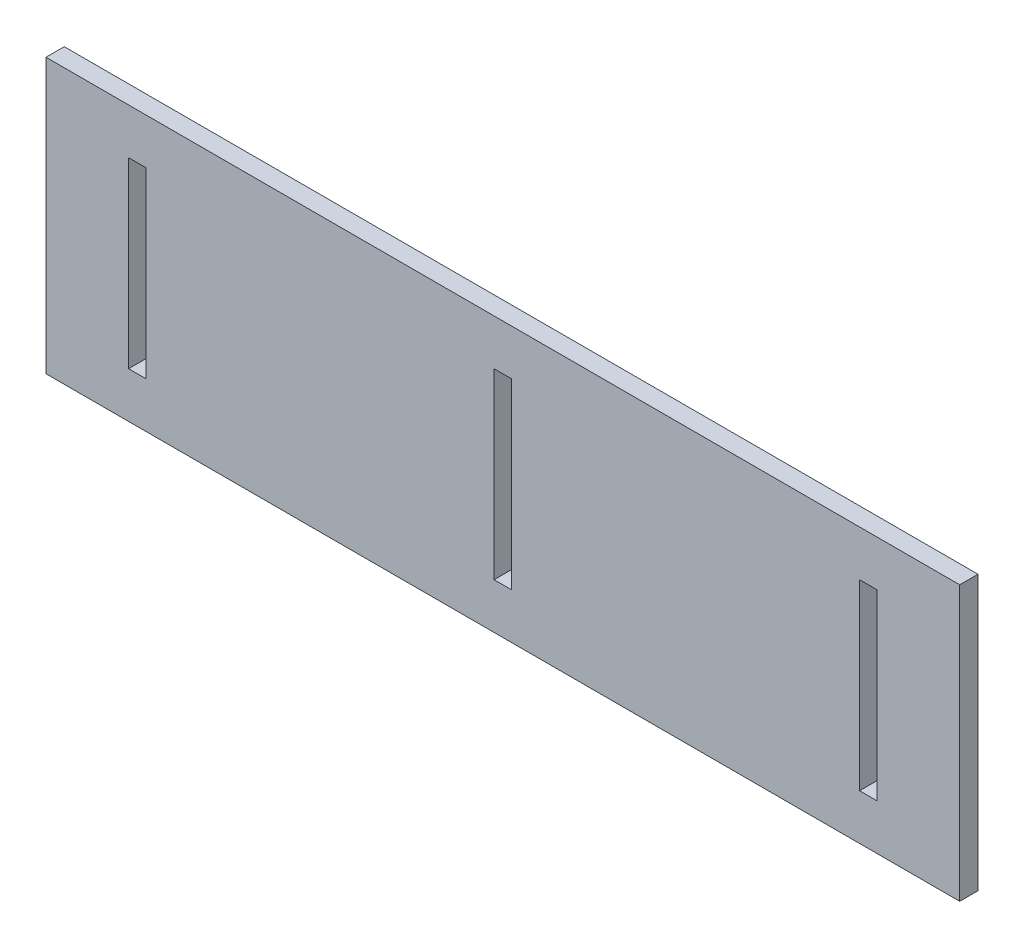
ISO-10303-21;
HEADER;
FILE_DESCRIPTION(('STEP AP214'),'2;1');
FILE_NAME('part.step','',(''),(''),'','','');
FILE_SCHEMA(('AUTOMOTIVE_DESIGN { 1 0 10303 214 1 1 1 1 }'));
ENDSEC;
DATA;
#1=APPLICATION_CONTEXT('core data for automotive mechanical design processes');
#2=APPLICATION_PROTOCOL_DEFINITION('international standard','automotive_design',2000,#1);
#3=PRODUCT_CONTEXT('',#1,'mechanical');
#4=PRODUCT('Part','Part','',(#3));
#5=PRODUCT_RELATED_PRODUCT_CATEGORY('part','',(#4));
#6=PRODUCT_DEFINITION_FORMATION('','',#4);
#7=PRODUCT_DEFINITION_CONTEXT('part definition',#1,'design');
#8=PRODUCT_DEFINITION('design','',#6,#7);
#9=PRODUCT_DEFINITION_SHAPE('','',#8);
#10=(LENGTH_UNIT() NAMED_UNIT(*) SI_UNIT(.MILLI.,.METRE.));
#11=(NAMED_UNIT(*) PLANE_ANGLE_UNIT() SI_UNIT($,.RADIAN.));
#12=(NAMED_UNIT(*) SI_UNIT($,.STERADIAN.) SOLID_ANGLE_UNIT());
#13=UNCERTAINTY_MEASURE_WITH_UNIT(LENGTH_MEASURE(1.E-05),#10,'distance_accuracy_value','');
#14=(GEOMETRIC_REPRESENTATION_CONTEXT(3) GLOBAL_UNCERTAINTY_ASSIGNED_CONTEXT((#13)) GLOBAL_UNIT_ASSIGNED_CONTEXT((#10,
#11,#12)) REPRESENTATION_CONTEXT('',''));
#15=CARTESIAN_POINT('',(0.,0.,0.));
#16=DIRECTION('',(0.,0.,1.));
#17=DIRECTION('',(1.,0.,0.));
#18=AXIS2_PLACEMENT_3D('',#15,#16,#17);
#19=CARTESIAN_POINT('',(125.01,37.5,-0.01));
#20=DIRECTION('',(0.,1.,0.));
#21=DIRECTION('',(-1.,0.,0.));
#22=AXIS2_PLACEMENT_3D('',#19,#20,#21);
#23=PLANE('',#22);
#24=DIRECTION('',(-1.,0.,0.));
#25=VECTOR('',#24,1.);
#26=CARTESIAN_POINT('',(0.,37.5,5.));
#27=LINE('',#26,#25);
#28=CARTESIAN_POINT('',(125.,37.5,5.));
#29=VERTEX_POINT('',#28);
#30=CARTESIAN_POINT('',(-125.,37.5,5.));
#31=VERTEX_POINT('',#30);
#32=EDGE_CURVE('E133',#29,#31,#27,.T.);
#33=ORIENTED_EDGE('',*,*,#32,.F.);
#34=DIRECTION('',(0.,0.,1.));
#35=VECTOR('',#34,1.);
#36=CARTESIAN_POINT('',(125.,37.5,2.5));
#37=LINE('',#36,#35);
#38=CARTESIAN_POINT('',(125.,37.5,0.));
#39=VERTEX_POINT('',#38);
#40=EDGE_CURVE('E130',#39,#29,#37,.T.);
#41=ORIENTED_EDGE('',*,*,#40,.F.);
#42=DIRECTION('',(1.,0.,0.));
#43=VECTOR('',#42,1.);
#44=CARTESIAN_POINT('',(0.,37.5,0.));
#45=LINE('',#44,#43);
#46=CARTESIAN_POINT('',(-125.,37.5,0.));
#47=VERTEX_POINT('',#46);
#48=EDGE_CURVE('E127',#47,#39,#45,.T.);
#49=ORIENTED_EDGE('',*,*,#48,.F.);
#50=DIRECTION('',(0.,0.,-1.));
#51=VECTOR('',#50,1.);
#52=CARTESIAN_POINT('',(-125.,37.5,2.5));
#53=LINE('',#52,#51);
#54=EDGE_CURVE('E20',#31,#47,#53,.T.);
#55=ORIENTED_EDGE('',*,*,#54,.F.);
#56=EDGE_LOOP('',(#33,#41,#49,#55));
#57=FACE_BOUND('',#56,.T.);
#58=ADVANCED_FACE('F16',(#57),#23,.T.);
#59=CARTESIAN_POINT('',(-125.,37.51,-0.01));
#60=DIRECTION('',(-1.,0.,0.));
#61=DIRECTION('',(0.,-1.,0.));
#62=AXIS2_PLACEMENT_3D('',#59,#60,#61);
#63=PLANE('',#62);
#64=DIRECTION('',(0.,-1.,0.));
#65=VECTOR('',#64,1.);
#66=CARTESIAN_POINT('',(-125.,0.,5.));
#67=LINE('',#66,#65);
#68=CARTESIAN_POINT('',(-125.,-37.5,5.));
#69=VERTEX_POINT('',#68);
#70=EDGE_CURVE('E181',#31,#69,#67,.T.);
#71=ORIENTED_EDGE('',*,*,#70,.F.);
#72=ORIENTED_EDGE('',*,*,#54,.T.);
#73=DIRECTION('',(0.,1.,0.));
#74=VECTOR('',#73,1.);
#75=CARTESIAN_POINT('',(-125.,0.,0.));
#76=LINE('',#75,#74);
#77=CARTESIAN_POINT('',(-125.,-37.5,0.));
#78=VERTEX_POINT('',#77);
#79=EDGE_CURVE('E151',#78,#47,#76,.T.);
#80=ORIENTED_EDGE('',*,*,#79,.F.);
#81=DIRECTION('',(0.,0.,-1.));
#82=VECTOR('',#81,1.);
#83=CARTESIAN_POINT('',(-125.,-37.5,2.5));
#84=LINE('',#83,#82);
#85=EDGE_CURVE('E138',#69,#78,#84,.T.);
#86=ORIENTED_EDGE('',*,*,#85,.F.);
#87=EDGE_LOOP('',(#71,#72,#80,#86));
#88=FACE_BOUND('',#87,.T.);
#89=ADVANCED_FACE('F179',(#88),#63,.T.);
#90=CARTESIAN_POINT('',(-125.01,-37.5,-0.01));
#91=DIRECTION('',(0.,-1.,0.));
#92=DIRECTION('',(1.,0.,0.));
#93=AXIS2_PLACEMENT_3D('',#90,#91,#92);
#94=PLANE('',#93);
#95=DIRECTION('',(1.,0.,0.));
#96=VECTOR('',#95,1.);
#97=CARTESIAN_POINT('',(0.,-37.5,5.));
#98=LINE('',#97,#96);
#99=CARTESIAN_POINT('',(125.,-37.5,5.));
#100=VERTEX_POINT('',#99);
#101=EDGE_CURVE('E184',#69,#100,#98,.T.);
#102=ORIENTED_EDGE('',*,*,#101,.F.);
#103=ORIENTED_EDGE('',*,*,#85,.T.);
#104=DIRECTION('',(-1.,0.,0.));
#105=VECTOR('',#104,1.);
#106=CARTESIAN_POINT('',(0.,-37.5,0.));
#107=LINE('',#106,#105);
#108=CARTESIAN_POINT('',(125.,-37.5,0.));
#109=VERTEX_POINT('',#108);
#110=EDGE_CURVE('E146',#109,#78,#107,.T.);
#111=ORIENTED_EDGE('',*,*,#110,.F.);
#112=DIRECTION('',(0.,0.,-1.));
#113=VECTOR('',#112,1.);
#114=CARTESIAN_POINT('',(125.,-37.5,2.5));
#115=LINE('',#114,#113);
#116=EDGE_CURVE('E137',#100,#109,#115,.T.);
#117=ORIENTED_EDGE('',*,*,#116,.F.);
#118=EDGE_LOOP('',(#102,#103,#111,#117));
#119=FACE_BOUND('',#118,.T.);
#120=ADVANCED_FACE('F222',(#119),#94,.T.);
#121=CARTESIAN_POINT('',(125.,-37.51,-0.01));
#122=DIRECTION('',(1.,0.,0.));
#123=DIRECTION('',(0.,1.,0.));
#124=AXIS2_PLACEMENT_3D('',#121,#122,#123);
#125=PLANE('',#124);
#126=DIRECTION('',(0.,1.,0.));
#127=VECTOR('',#126,1.);
#128=CARTESIAN_POINT('',(125.,0.,5.));
#129=LINE('',#128,#127);
#130=EDGE_CURVE('E187',#100,#29,#129,.T.);
#131=ORIENTED_EDGE('',*,*,#130,.F.);
#132=ORIENTED_EDGE('',*,*,#116,.T.);
#133=DIRECTION('',(0.,-1.,0.));
#134=VECTOR('',#133,1.);
#135=CARTESIAN_POINT('',(125.,0.,0.));
#136=LINE('',#135,#134);
#137=EDGE_CURVE('E141',#39,#109,#136,.T.);
#138=ORIENTED_EDGE('',*,*,#137,.F.);
#139=ORIENTED_EDGE('',*,*,#40,.T.);
#140=EDGE_LOOP('',(#131,#132,#138,#139));
#141=FACE_BOUND('',#140,.T.);
#142=ADVANCED_FACE('F142',(#141),#125,.T.);
#143=CARTESIAN_POINT('',(2.4,-25.01,5.01));
#144=DIRECTION('',(-1.,0.,0.));
#145=DIRECTION('',(0.,1.,0.));
#146=AXIS2_PLACEMENT_3D('',#143,#144,#145);
#147=PLANE('',#146);
#148=DIRECTION('',(0.,-1.,0.));
#149=VECTOR('',#148,1.);
#150=CARTESIAN_POINT('',(2.40000000000001,0.,5.));
#151=LINE('',#150,#149);
#152=CARTESIAN_POINT('',(2.4,25.,5.));
#153=VERTEX_POINT('',#152);
#154=CARTESIAN_POINT('',(2.4,-25.,5.));
#155=VERTEX_POINT('',#154);
#156=EDGE_CURVE('E230',#153,#155,#151,.T.);
#157=ORIENTED_EDGE('',*,*,#156,.F.);
#158=DIRECTION('',(0.,0.,1.));
#159=VECTOR('',#158,1.);
#160=CARTESIAN_POINT('',(2.4,25.,2.5));
#161=LINE('',#160,#159);
#162=CARTESIAN_POINT('',(2.4,25.,0.));
#163=VERTEX_POINT('',#162);
#164=EDGE_CURVE('E167',#163,#153,#161,.T.);
#165=ORIENTED_EDGE('',*,*,#164,.F.);
#166=DIRECTION('',(0.,1.,0.));
#167=VECTOR('',#166,1.);
#168=CARTESIAN_POINT('',(2.4,0.,0.));
#169=LINE('',#168,#167);
#170=CARTESIAN_POINT('',(2.4,-25.,0.));
#171=VERTEX_POINT('',#170);
#172=EDGE_CURVE('E217',#171,#163,#169,.T.);
#173=ORIENTED_EDGE('',*,*,#172,.F.);
#174=DIRECTION('',(0.,0.,-1.));
#175=VECTOR('',#174,1.);
#176=CARTESIAN_POINT('',(2.4,-25.,2.5));
#177=LINE('',#176,#175);
#178=EDGE_CURVE('E172',#155,#171,#177,.T.);
#179=ORIENTED_EDGE('',*,*,#178,.F.);
#180=EDGE_LOOP('',(#157,#165,#173,#179));
#181=FACE_BOUND('',#180,.T.);
#182=ADVANCED_FACE('F317',(#181),#147,.T.);
#183=CARTESIAN_POINT('',(-2.41,-25.,5.01));
#184=DIRECTION('',(0.,1.,0.));
#185=DIRECTION('',(1.,0.,0.));
#186=AXIS2_PLACEMENT_3D('',#183,#184,#185);
#187=PLANE('',#186);
#188=DIRECTION('',(-1.,0.,0.));
#189=VECTOR('',#188,1.);
#190=CARTESIAN_POINT('',(0.,-25.,5.));
#191=LINE('',#190,#189);
#192=CARTESIAN_POINT('',(-2.4,-25.,5.));
#193=VERTEX_POINT('',#192);
#194=EDGE_CURVE('E233',#155,#193,#191,.T.);
#195=ORIENTED_EDGE('',*,*,#194,.F.);
#196=ORIENTED_EDGE('',*,*,#178,.T.);
#197=DIRECTION('',(1.,0.,0.));
#198=VECTOR('',#197,1.);
#199=CARTESIAN_POINT('',(0.,-25.,0.));
#200=LINE('',#199,#198);
#201=CARTESIAN_POINT('',(-2.4,-25.,0.));
#202=VERTEX_POINT('',#201);
#203=EDGE_CURVE('E208',#202,#171,#200,.T.);
#204=ORIENTED_EDGE('',*,*,#203,.F.);
#205=DIRECTION('',(0.,0.,-1.));
#206=VECTOR('',#205,1.);
#207=CARTESIAN_POINT('',(-2.4,-25.,2.5));
#208=LINE('',#207,#206);
#209=EDGE_CURVE('E170',#193,#202,#208,.T.);
#210=ORIENTED_EDGE('',*,*,#209,.F.);
#211=EDGE_LOOP('',(#195,#196,#204,#210));
#212=FACE_BOUND('',#211,.T.);
#213=ADVANCED_FACE('F319',(#212),#187,.T.);
#214=CARTESIAN_POINT('',(-2.4,25.01,5.01));
#215=DIRECTION('',(1.,0.,0.));
#216=DIRECTION('',(0.,-1.,0.));
#217=AXIS2_PLACEMENT_3D('',#214,#215,#216);
#218=PLANE('',#217);
#219=DIRECTION('',(0.,1.,0.));
#220=VECTOR('',#219,1.);
#221=CARTESIAN_POINT('',(-2.4,0.,5.));
#222=LINE('',#221,#220);
#223=CARTESIAN_POINT('',(-2.4,25.,5.));
#224=VERTEX_POINT('',#223);
#225=EDGE_CURVE('E236',#193,#224,#222,.T.);
#226=ORIENTED_EDGE('',*,*,#225,.F.);
#227=ORIENTED_EDGE('',*,*,#209,.T.);
#228=DIRECTION('',(0.,-1.,0.));
#229=VECTOR('',#228,1.);
#230=CARTESIAN_POINT('',(-2.40000000000001,0.,0.));
#231=LINE('',#230,#229);
#232=CARTESIAN_POINT('',(-2.4,25.,0.));
#233=VERTEX_POINT('',#232);
#234=EDGE_CURVE('E211',#233,#202,#231,.T.);
#235=ORIENTED_EDGE('',*,*,#234,.F.);
#236=DIRECTION('',(0.,0.,-1.));
#237=VECTOR('',#236,1.);
#238=CARTESIAN_POINT('',(-2.4,25.,2.5));
#239=LINE('',#238,#237);
#240=EDGE_CURVE('E165',#224,#233,#239,.T.);
#241=ORIENTED_EDGE('',*,*,#240,.F.);
#242=EDGE_LOOP('',(#226,#227,#235,#241));
#243=FACE_BOUND('',#242,.T.);
#244=ADVANCED_FACE('F310',(#243),#218,.T.);
#245=CARTESIAN_POINT('',(2.41,25.,5.01));
#246=DIRECTION('',(0.,-1.,0.));
#247=DIRECTION('',(-1.,0.,0.));
#248=AXIS2_PLACEMENT_3D('',#245,#246,#247);
#249=PLANE('',#248);
#250=DIRECTION('',(1.,0.,0.));
#251=VECTOR('',#250,1.);
#252=CARTESIAN_POINT('',(0.,25.,5.));
#253=LINE('',#252,#251);
#254=EDGE_CURVE('E239',#224,#153,#253,.T.);
#255=ORIENTED_EDGE('',*,*,#254,.F.);
#256=ORIENTED_EDGE('',*,*,#240,.T.);
#257=DIRECTION('',(-1.,0.,0.));
#258=VECTOR('',#257,1.);
#259=CARTESIAN_POINT('',(0.,25.,0.));
#260=LINE('',#259,#258);
#261=EDGE_CURVE('E214',#163,#233,#260,.T.);
#262=ORIENTED_EDGE('',*,*,#261,.F.);
#263=ORIENTED_EDGE('',*,*,#164,.T.);
#264=EDGE_LOOP('',(#255,#256,#262,#263));
#265=FACE_BOUND('',#264,.T.);
#266=ADVANCED_FACE('F315',(#265),#249,.T.);
#267=CARTESIAN_POINT('',(-97.6,-25.0099999999999,5.01));
#268=DIRECTION('',(-1.,0.,0.));
#269=DIRECTION('',(0.,1.,0.));
#270=AXIS2_PLACEMENT_3D('',#267,#268,#269);
#271=PLANE('',#270);
#272=DIRECTION('',(0.,-1.,0.));
#273=VECTOR('',#272,1.);
#274=CARTESIAN_POINT('',(-97.6,0.,5.));
#275=LINE('',#274,#273);
#276=CARTESIAN_POINT('',(-97.6,25.0000000000001,5.));
#277=VERTEX_POINT('',#276);
#278=CARTESIAN_POINT('',(-97.6,-24.9999999999999,5.));
#279=VERTEX_POINT('',#278);
#280=EDGE_CURVE('E242',#277,#279,#275,.T.);
#281=ORIENTED_EDGE('',*,*,#280,.F.);
#282=DIRECTION('',(0.,0.,1.));
#283=VECTOR('',#282,1.);
#284=CARTESIAN_POINT('',(-97.6,25.0000000000001,2.5));
#285=LINE('',#284,#283);
#286=CARTESIAN_POINT('',(-97.6,25.0000000000001,0.));
#287=VERTEX_POINT('',#286);
#288=EDGE_CURVE('E154',#287,#277,#285,.T.);
#289=ORIENTED_EDGE('',*,*,#288,.F.);
#290=DIRECTION('',(0.,1.,0.));
#291=VECTOR('',#290,1.);
#292=CARTESIAN_POINT('',(-97.6,0.,0.));
#293=LINE('',#292,#291);
#294=CARTESIAN_POINT('',(-97.6,-24.9999999999999,0.));
#295=VERTEX_POINT('',#294);
#296=EDGE_CURVE('E205',#295,#287,#293,.T.);
#297=ORIENTED_EDGE('',*,*,#296,.F.);
#298=DIRECTION('',(0.,0.,-1.));
#299=VECTOR('',#298,1.);
#300=CARTESIAN_POINT('',(-97.6,-24.9999999999999,2.5));
#301=LINE('',#300,#299);
#302=EDGE_CURVE('E162',#279,#295,#301,.T.);
#303=ORIENTED_EDGE('',*,*,#302,.F.);
#304=EDGE_LOOP('',(#281,#289,#297,#303));
#305=FACE_BOUND('',#304,.T.);
#306=ADVANCED_FACE('F332',(#305),#271,.T.);
#307=CARTESIAN_POINT('',(-102.41,-24.9999999999999,5.01));
#308=DIRECTION('',(0.,1.,0.));
#309=DIRECTION('',(1.,0.,0.));
#310=AXIS2_PLACEMENT_3D('',#307,#308,#309);
#311=PLANE('',#310);
#312=DIRECTION('',(-1.,0.,0.));
#313=VECTOR('',#312,1.);
#314=CARTESIAN_POINT('',(0.,-24.9999999999999,5.));
#315=LINE('',#314,#313);
#316=CARTESIAN_POINT('',(-102.4,-24.9999999999999,5.));
#317=VERTEX_POINT('',#316);
#318=EDGE_CURVE('E245',#279,#317,#315,.T.);
#319=ORIENTED_EDGE('',*,*,#318,.F.);
#320=ORIENTED_EDGE('',*,*,#302,.T.);
#321=DIRECTION('',(1.,0.,0.));
#322=VECTOR('',#321,1.);
#323=CARTESIAN_POINT('',(0.,-24.9999999999999,0.));
#324=LINE('',#323,#322);
#325=CARTESIAN_POINT('',(-102.4,-24.9999999999999,0.));
#326=VERTEX_POINT('',#325);
#327=EDGE_CURVE('E196',#326,#295,#324,.T.);
#328=ORIENTED_EDGE('',*,*,#327,.F.);
#329=DIRECTION('',(0.,0.,-1.));
#330=VECTOR('',#329,1.);
#331=CARTESIAN_POINT('',(-102.4,-24.9999999999999,2.5));
#332=LINE('',#331,#330);
#333=EDGE_CURVE('E160',#317,#326,#332,.T.);
#334=ORIENTED_EDGE('',*,*,#333,.F.);
#335=EDGE_LOOP('',(#319,#320,#328,#334));
#336=FACE_BOUND('',#335,.T.);
#337=ADVANCED_FACE('F335',(#336),#311,.T.);
#338=CARTESIAN_POINT('',(-102.4,25.0100000000001,5.01));
#339=DIRECTION('',(1.,0.,0.));
#340=DIRECTION('',(0.,-1.,0.));
#341=AXIS2_PLACEMENT_3D('',#338,#339,#340);
#342=PLANE('',#341);
#343=DIRECTION('',(0.,1.,0.));
#344=VECTOR('',#343,1.);
#345=CARTESIAN_POINT('',(-102.4,0.,5.));
#346=LINE('',#345,#344);
#347=CARTESIAN_POINT('',(-102.4,25.0000000000001,5.));
#348=VERTEX_POINT('',#347);
#349=EDGE_CURVE('E248',#317,#348,#346,.T.);
#350=ORIENTED_EDGE('',*,*,#349,.F.);
#351=ORIENTED_EDGE('',*,*,#333,.T.);
#352=DIRECTION('',(0.,-1.,0.));
#353=VECTOR('',#352,1.);
#354=CARTESIAN_POINT('',(-102.4,0.,0.));
#355=LINE('',#354,#353);
#356=CARTESIAN_POINT('',(-102.4,25.0000000000001,0.));
#357=VERTEX_POINT('',#356);
#358=EDGE_CURVE('E199',#357,#326,#355,.T.);
#359=ORIENTED_EDGE('',*,*,#358,.F.);
#360=DIRECTION('',(0.,0.,-1.));
#361=VECTOR('',#360,1.);
#362=CARTESIAN_POINT('',(-102.4,25.0000000000001,2.5));
#363=LINE('',#362,#361);
#364=EDGE_CURVE('E152',#348,#357,#363,.T.);
#365=ORIENTED_EDGE('',*,*,#364,.F.);
#366=EDGE_LOOP('',(#350,#351,#359,#365));
#367=FACE_BOUND('',#366,.T.);
#368=ADVANCED_FACE('F339',(#367),#342,.T.);
#369=CARTESIAN_POINT('',(-97.59,25.0000000000001,5.01));
#370=DIRECTION('',(0.,-1.,0.));
#371=DIRECTION('',(-1.,0.,0.));
#372=AXIS2_PLACEMENT_3D('',#369,#370,#371);
#373=PLANE('',#372);
#374=DIRECTION('',(1.,0.,0.));
#375=VECTOR('',#374,1.);
#376=CARTESIAN_POINT('',(0.,25.0000000000001,5.));
#377=LINE('',#376,#375);
#378=EDGE_CURVE('E251',#348,#277,#377,.T.);
#379=ORIENTED_EDGE('',*,*,#378,.F.);
#380=ORIENTED_EDGE('',*,*,#364,.T.);
#381=DIRECTION('',(-1.,0.,0.));
#382=VECTOR('',#381,1.);
#383=CARTESIAN_POINT('',(0.,25.0000000000001,0.));
#384=LINE('',#383,#382);
#385=EDGE_CURVE('E202',#287,#357,#384,.T.);
#386=ORIENTED_EDGE('',*,*,#385,.F.);
#387=ORIENTED_EDGE('',*,*,#288,.T.);
#388=EDGE_LOOP('',(#379,#380,#386,#387));
#389=FACE_BOUND('',#388,.T.);
#390=ADVANCED_FACE('F290',(#389),#373,.T.);
#391=CARTESIAN_POINT('',(97.6000000000001,25.0099999999996,5.01));
#392=DIRECTION('',(1.,0.,0.));
#393=DIRECTION('',(0.,-1.,0.));
#394=AXIS2_PLACEMENT_3D('',#391,#392,#393);
#395=PLANE('',#394);
#396=DIRECTION('',(0.,1.,0.));
#397=VECTOR('',#396,1.);
#398=CARTESIAN_POINT('',(97.6000000000001,0.,5.));
#399=LINE('',#398,#397);
#400=CARTESIAN_POINT('',(97.6000000000001,-25.0000000000005,5.));
#401=VERTEX_POINT('',#400);
#402=CARTESIAN_POINT('',(97.6000000000001,24.9999999999995,5.));
#403=VERTEX_POINT('',#402);
#404=EDGE_CURVE('E228',#401,#403,#399,.T.);
#405=ORIENTED_EDGE('',*,*,#404,.F.);
#406=DIRECTION('',(0.,0.,1.));
#407=VECTOR('',#406,1.);
#408=CARTESIAN_POINT('',(97.6000000000001,-25.0000000000005,2.5));
#409=LINE('',#408,#407);
#410=CARTESIAN_POINT('',(97.6000000000001,-25.0000000000005,0.));
#411=VERTEX_POINT('',#410);
#412=EDGE_CURVE('E188',#411,#401,#409,.T.);
#413=ORIENTED_EDGE('',*,*,#412,.F.);
#414=DIRECTION('',(0.,-1.,0.));
#415=VECTOR('',#414,1.);
#416=CARTESIAN_POINT('',(97.6000000000001,0.,0.));
#417=LINE('',#416,#415);
#418=CARTESIAN_POINT('',(97.6000000000001,24.9999999999995,0.));
#419=VERTEX_POINT('',#418);
#420=EDGE_CURVE('E220',#419,#411,#417,.T.);
#421=ORIENTED_EDGE('',*,*,#420,.F.);
#422=DIRECTION('',(0.,0.,-1.));
#423=VECTOR('',#422,1.);
#424=CARTESIAN_POINT('',(97.6000000000001,24.9999999999995,2.5));
#425=LINE('',#424,#423);
#426=EDGE_CURVE('E258',#403,#419,#425,.T.);
#427=ORIENTED_EDGE('',*,*,#426,.F.);
#428=EDGE_LOOP('',(#405,#413,#421,#427));
#429=FACE_BOUND('',#428,.T.);
#430=ADVANCED_FACE('F276',(#429),#395,.T.);
#431=CARTESIAN_POINT('',(125.01,-37.51,0.));
#432=DIRECTION('',(0.,0.,-1.));
#433=DIRECTION('',(-1.,0.,0.));
#434=AXIS2_PLACEMENT_3D('',#431,#432,#433);
#435=PLANE('',#434);
#436=ORIENTED_EDGE('',*,*,#358,.T.);
#437=ORIENTED_EDGE('',*,*,#327,.T.);
#438=ORIENTED_EDGE('',*,*,#296,.T.);
#439=ORIENTED_EDGE('',*,*,#385,.T.);
#440=EDGE_LOOP('',(#436,#437,#438,#439));
#441=FACE_BOUND('',#440,.T.);
#442=ORIENTED_EDGE('',*,*,#234,.T.);
#443=ORIENTED_EDGE('',*,*,#203,.T.);
#444=ORIENTED_EDGE('',*,*,#172,.T.);
#445=ORIENTED_EDGE('',*,*,#261,.T.);
#446=EDGE_LOOP('',(#442,#443,#444,#445));
#447=FACE_BOUND('',#446,.T.);
#448=ORIENTED_EDGE('',*,*,#420,.T.);
#449=DIRECTION('',(-1.,0.,0.));
#450=VECTOR('',#449,1.);
#451=CARTESIAN_POINT('',(100.,-25.0000000000005,0.));
#452=LINE('',#451,#450);
#453=CARTESIAN_POINT('',(102.4,-25.0000000000005,0.));
#454=VERTEX_POINT('',#453);
#455=EDGE_CURVE('E190',#454,#411,#452,.T.);
#456=ORIENTED_EDGE('',*,*,#455,.F.);
#457=DIRECTION('',(0.,-1.,0.));
#458=VECTOR('',#457,1.);
#459=CARTESIAN_POINT('',(102.4,-4.9439619065339E-13,0.));
#460=LINE('',#459,#458);
#461=CARTESIAN_POINT('',(102.4,24.9999999999995,0.));
#462=VERTEX_POINT('',#461);
#463=EDGE_CURVE('E261',#462,#454,#460,.T.);
#464=ORIENTED_EDGE('',*,*,#463,.F.);
#465=DIRECTION('',(1.,0.,0.));
#466=VECTOR('',#465,1.);
#467=CARTESIAN_POINT('',(100.,24.9999999999995,0.));
#468=LINE('',#467,#466);
#469=EDGE_CURVE('E254',#419,#462,#468,.T.);
#470=ORIENTED_EDGE('',*,*,#469,.F.);
#471=EDGE_LOOP('',(#448,#456,#464,#470));
#472=FACE_BOUND('',#471,.T.);
#473=ORIENTED_EDGE('',*,*,#110,.T.);
#474=ORIENTED_EDGE('',*,*,#79,.T.);
#475=ORIENTED_EDGE('',*,*,#48,.T.);
#476=ORIENTED_EDGE('',*,*,#137,.T.);
#477=EDGE_LOOP('',(#473,#474,#475,#476));
#478=FACE_BOUND('',#477,.T.);
#479=ADVANCED_FACE('F149',(#441,#447,#472,#478),#435,.T.);
#480=CARTESIAN_POINT('',(97.5900000000001,-25.0000000000005,5.01));
#481=DIRECTION('',(0.,1.,0.));
#482=DIRECTION('',(1.,0.,0.));
#483=AXIS2_PLACEMENT_3D('',#480,#481,#482);
#484=PLANE('',#483);
#485=DIRECTION('',(-1.,0.,0.));
#486=VECTOR('',#485,1.);
#487=CARTESIAN_POINT('',(0.,-25.0000000000005,5.));
#488=LINE('',#487,#486);
#489=CARTESIAN_POINT('',(102.4,-25.0000000000005,5.));
#490=VERTEX_POINT('',#489);
#491=EDGE_CURVE('E223',#490,#401,#488,.T.);
#492=ORIENTED_EDGE('',*,*,#491,.F.);
#493=DIRECTION('',(0.,0.,1.));
#494=VECTOR('',#493,1.);
#495=CARTESIAN_POINT('',(102.4,-25.0000000000005,2.5));
#496=LINE('',#495,#494);
#497=EDGE_CURVE('E264',#454,#490,#496,.T.);
#498=ORIENTED_EDGE('',*,*,#497,.F.);
#499=ORIENTED_EDGE('',*,*,#455,.T.);
#500=ORIENTED_EDGE('',*,*,#412,.T.);
#501=EDGE_LOOP('',(#492,#498,#499,#500));
#502=FACE_BOUND('',#501,.T.);
#503=ADVANCED_FACE('F273',(#502),#484,.T.);
#504=CARTESIAN_POINT('',(-125.01,-37.51,5.));
#505=DIRECTION('',(0.,0.,1.));
#506=DIRECTION('',(1.,0.,0.));
#507=AXIS2_PLACEMENT_3D('',#504,#505,#506);
#508=PLANE('',#507);
#509=ORIENTED_EDGE('',*,*,#349,.T.);
#510=ORIENTED_EDGE('',*,*,#378,.T.);
#511=ORIENTED_EDGE('',*,*,#280,.T.);
#512=ORIENTED_EDGE('',*,*,#318,.T.);
#513=EDGE_LOOP('',(#509,#510,#511,#512));
#514=FACE_BOUND('',#513,.T.);
#515=ORIENTED_EDGE('',*,*,#225,.T.);
#516=ORIENTED_EDGE('',*,*,#254,.T.);
#517=ORIENTED_EDGE('',*,*,#156,.T.);
#518=ORIENTED_EDGE('',*,*,#194,.T.);
#519=EDGE_LOOP('',(#515,#516,#517,#518));
#520=FACE_BOUND('',#519,.T.);
#521=ORIENTED_EDGE('',*,*,#404,.T.);
#522=DIRECTION('',(-1.,0.,0.));
#523=VECTOR('',#522,1.);
#524=CARTESIAN_POINT('',(100.,24.9999999999995,5.));
#525=LINE('',#524,#523);
#526=CARTESIAN_POINT('',(102.4,24.9999999999995,5.));
#527=VERTEX_POINT('',#526);
#528=EDGE_CURVE('E35',#527,#403,#525,.T.);
#529=ORIENTED_EDGE('',*,*,#528,.F.);
#530=DIRECTION('',(0.,1.,0.));
#531=VECTOR('',#530,1.);
#532=CARTESIAN_POINT('',(102.4,-4.96130914129367E-13,5.));
#533=LINE('',#532,#531);
#534=EDGE_CURVE('E26',#490,#527,#533,.T.);
#535=ORIENTED_EDGE('',*,*,#534,.F.);
#536=ORIENTED_EDGE('',*,*,#491,.T.);
#537=EDGE_LOOP('',(#521,#529,#535,#536));
#538=FACE_BOUND('',#537,.T.);
#539=ORIENTED_EDGE('',*,*,#101,.T.);
#540=ORIENTED_EDGE('',*,*,#130,.T.);
#541=ORIENTED_EDGE('',*,*,#32,.T.);
#542=ORIENTED_EDGE('',*,*,#70,.T.);
#543=EDGE_LOOP('',(#539,#540,#541,#542));
#544=FACE_BOUND('',#543,.T.);
#545=ADVANCED_FACE('F186',(#514,#520,#538,#544),#508,.T.);
#546=CARTESIAN_POINT('',(102.41,24.9999999999995,5.01));
#547=DIRECTION('',(0.,-1.,0.));
#548=DIRECTION('',(-1.,0.,0.));
#549=AXIS2_PLACEMENT_3D('',#546,#547,#548);
#550=PLANE('',#549);
#551=ORIENTED_EDGE('',*,*,#528,.T.);
#552=ORIENTED_EDGE('',*,*,#426,.T.);
#553=ORIENTED_EDGE('',*,*,#469,.T.);
#554=DIRECTION('',(0.,0.,-1.));
#555=VECTOR('',#554,1.);
#556=CARTESIAN_POINT('',(102.4,24.9999999999995,2.5));
#557=LINE('',#556,#555);
#558=EDGE_CURVE('E11',#527,#462,#557,.T.);
#559=ORIENTED_EDGE('',*,*,#558,.F.);
#560=EDGE_LOOP('',(#551,#552,#553,#559));
#561=FACE_BOUND('',#560,.T.);
#562=ADVANCED_FACE('F279',(#561),#550,.T.);
#563=CARTESIAN_POINT('',(102.4,-25.0100000000005,5.01));
#564=DIRECTION('',(-1.,0.,0.));
#565=DIRECTION('',(0.,1.,0.));
#566=AXIS2_PLACEMENT_3D('',#563,#564,#565);
#567=PLANE('',#566);
#568=ORIENTED_EDGE('',*,*,#534,.T.);
#569=ORIENTED_EDGE('',*,*,#558,.T.);
#570=ORIENTED_EDGE('',*,*,#463,.T.);
#571=ORIENTED_EDGE('',*,*,#497,.T.);
#572=EDGE_LOOP('',(#568,#569,#570,#571));
#573=FACE_BOUND('',#572,.T.);
#574=ADVANCED_FACE('F18',(#573),#567,.T.);
#575=CLOSED_SHELL('',(#58,#89,#120,#142,#182,#213,#244,#266,#306,#337,#368,#390,#430,#479,#503,
#545,#562,#574));
#576=MANIFOLD_SOLID_BREP('B1',#575);
#577=ADVANCED_BREP_SHAPE_REPRESENTATION('',(#18,#576),#14);
#578=SHAPE_DEFINITION_REPRESENTATION(#9,#577);
ENDSEC;
END-ISO-10303-21;
